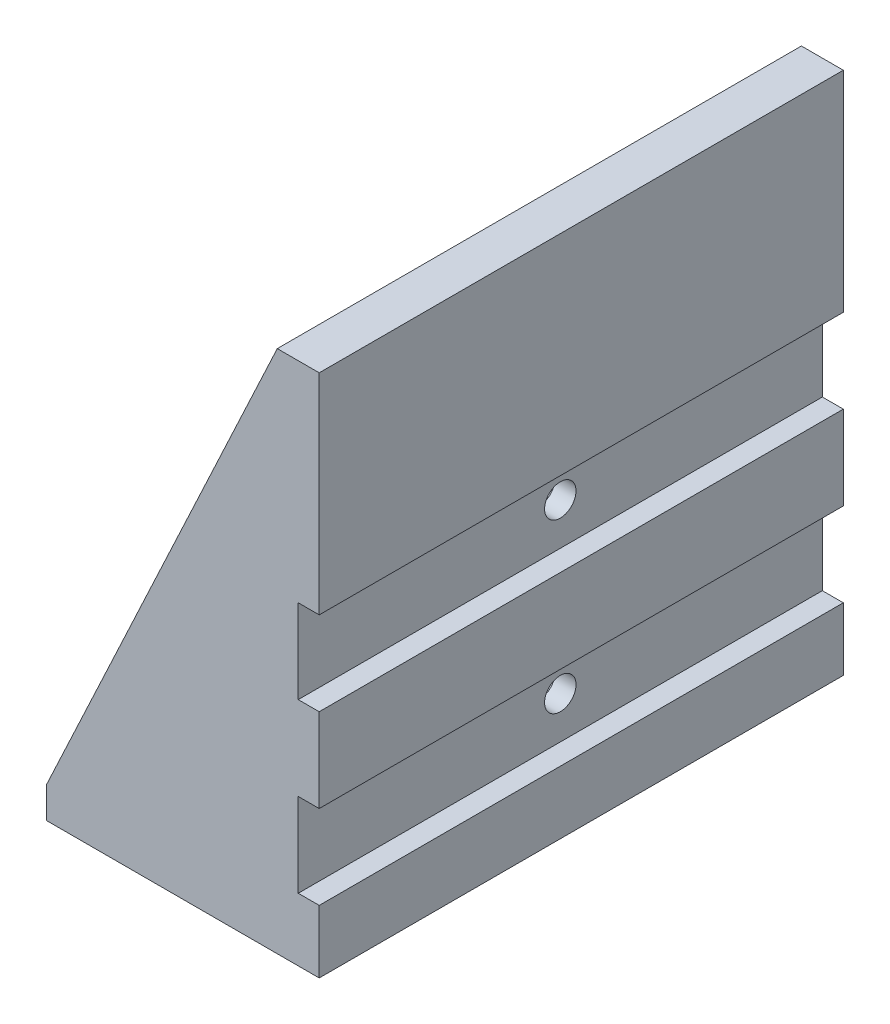
ISO-10303-21;
HEADER;
FILE_DESCRIPTION(('STEP AP214'),'2;1');
FILE_NAME('part.step','',(''),(''),'','','');
FILE_SCHEMA(('AUTOMOTIVE_DESIGN { 1 0 10303 214 1 1 1 1 }'));
ENDSEC;
DATA;
#1=APPLICATION_CONTEXT('core data for automotive mechanical design processes');
#2=APPLICATION_PROTOCOL_DEFINITION('international standard','automotive_design',2000,#1);
#3=PRODUCT_CONTEXT('',#1,'mechanical');
#4=PRODUCT('Part','Part','',(#3));
#5=PRODUCT_RELATED_PRODUCT_CATEGORY('part','',(#4));
#6=PRODUCT_DEFINITION_FORMATION('','',#4);
#7=PRODUCT_DEFINITION_CONTEXT('part definition',#1,'design');
#8=PRODUCT_DEFINITION('design','',#6,#7);
#9=PRODUCT_DEFINITION_SHAPE('','',#8);
#10=(LENGTH_UNIT() NAMED_UNIT(*) SI_UNIT(.MILLI.,.METRE.));
#11=(NAMED_UNIT(*) PLANE_ANGLE_UNIT() SI_UNIT($,.RADIAN.));
#12=(NAMED_UNIT(*) SI_UNIT($,.STERADIAN.) SOLID_ANGLE_UNIT());
#13=UNCERTAINTY_MEASURE_WITH_UNIT(LENGTH_MEASURE(1.E-05),#10,'distance_accuracy_value','');
#14=(GEOMETRIC_REPRESENTATION_CONTEXT(3) GLOBAL_UNCERTAINTY_ASSIGNED_CONTEXT((#13)) GLOBAL_UNIT_ASSIGNED_CONTEXT((#10,
#11,#12)) REPRESENTATION_CONTEXT('',''));
#15=CARTESIAN_POINT('',(0.,0.,0.));
#16=DIRECTION('',(0.,0.,1.));
#17=DIRECTION('',(1.,0.,0.));
#18=AXIS2_PLACEMENT_3D('',#15,#16,#17);
#19=CARTESIAN_POINT('',(-13.,3.,50.));
#20=DIRECTION('',(0.905690226558439,-0.423940106048631,0.));
#21=DIRECTION('',(0.423940106048631,0.905690226558439,0.));
#22=AXIS2_PLACEMENT_3D('',#19,#20,#21);
#23=PLANE('',#22);
#24=DIRECTION('',(0.,0.,-1.));
#25=VECTOR('',#24,1.);
#26=CARTESIAN_POINT('',(9.,50.,50.));
#27=LINE('',#26,#25);
#28=CARTESIAN_POINT('',(9.,50.,50.));
#29=VERTEX_POINT('',#28);
#30=CARTESIAN_POINT('',(9.,50.,47.5));
#31=VERTEX_POINT('',#30);
#32=EDGE_CURVE('E405',#29,#31,#27,.T.);
#33=ORIENTED_EDGE('',*,*,#32,.T.);
#34=DIRECTION('',(-0.423940106048631,-0.905690226558439,0.));
#35=VECTOR('',#34,1.);
#36=CARTESIAN_POINT('',(-13.,3.,47.5));
#37=LINE('',#36,#35);
#38=CARTESIAN_POINT('',(-10.6602168003031,7.99862774480703,47.5));
#39=VERTEX_POINT('',#38);
#40=EDGE_CURVE('E285',#31,#39,#37,.T.);
#41=ORIENTED_EDGE('',*,*,#40,.T.);
#42=CARTESIAN_POINT('',(-10.6602168003031,7.99862774480703,42.5));
#43=DIRECTION('',(0.905690226558439,-0.423940106048631,0.));
#44=DIRECTION('',(0.423940106048631,0.905690226558439,0.));
#45=AXIS2_PLACEMENT_3D('',#42,#43,#44);
#46=ELLIPSE('',#45,5.52065138099112,5.);
#47=CARTESIAN_POINT('',(-13.,3.,42.6171352587628));
#48=VERTEX_POINT('',#47);
#49=EDGE_CURVE('E533',#39,#48,#46,.T.);
#50=ORIENTED_EDGE('',*,*,#49,.T.);
#51=DIRECTION('',(0.,0.,-1.));
#52=VECTOR('',#51,1.);
#53=CARTESIAN_POINT('',(-13.,3.,50.));
#54=LINE('',#53,#52);
#55=CARTESIAN_POINT('',(-13.,3.,50.));
#56=VERTEX_POINT('',#55);
#57=EDGE_CURVE('E64',#56,#48,#54,.T.);
#58=ORIENTED_EDGE('',*,*,#57,.F.);
#59=DIRECTION('',(-0.423940106048631,-0.905690226558438,0.));
#60=VECTOR('',#59,1.);
#61=CARTESIAN_POINT('',(-13.,3.,50.));
#62=LINE('',#61,#60);
#63=EDGE_CURVE('E367',#29,#56,#62,.T.);
#64=ORIENTED_EDGE('',*,*,#63,.F.);
#65=EDGE_LOOP('',(#33,#41,#50,#58,#64));
#66=FACE_BOUND('',#65,.T.);
#67=ADVANCED_FACE('F39',(#66),#23,.F.);
#68=CARTESIAN_POINT('',(13.,0.,50.));
#69=DIRECTION('',(-1.,0.,0.));
#70=DIRECTION('',(0.,0.,1.));
#71=AXIS2_PLACEMENT_3D('',#68,#69,#70);
#72=PLANE('',#71);
#73=DIRECTION('',(0.,1.,0.));
#74=VECTOR('',#73,1.);
#75=CARTESIAN_POINT('',(13.,0.,50.));
#76=LINE('',#75,#74);
#77=CARTESIAN_POINT('',(13.,30.,50.));
#78=VERTEX_POINT('',#77);
#79=CARTESIAN_POINT('',(13.,50.,50.));
#80=VERTEX_POINT('',#79);
#81=EDGE_CURVE('E364',#78,#80,#76,.T.);
#82=ORIENTED_EDGE('',*,*,#81,.F.);
#83=DIRECTION('',(0.,0.,1.));
#84=VECTOR('',#83,1.);
#85=CARTESIAN_POINT('',(13.,30.,50.));
#86=LINE('',#85,#84);
#87=CARTESIAN_POINT('',(13.,30.,0.));
#88=VERTEX_POINT('',#87);
#89=EDGE_CURVE('E295',#88,#78,#86,.T.);
#90=ORIENTED_EDGE('',*,*,#89,.F.);
#91=DIRECTION('',(0.,1.,0.));
#92=VECTOR('',#91,1.);
#93=CARTESIAN_POINT('',(13.,0.,0.));
#94=LINE('',#93,#92);
#95=CARTESIAN_POINT('',(13.,50.,0.));
#96=VERTEX_POINT('',#95);
#97=EDGE_CURVE('E348',#88,#96,#94,.T.);
#98=ORIENTED_EDGE('',*,*,#97,.T.);
#99=DIRECTION('',(0.,0.,-1.));
#100=VECTOR('',#99,1.);
#101=CARTESIAN_POINT('',(13.,50.,50.));
#102=LINE('',#101,#100);
#103=EDGE_CURVE('E409',#80,#96,#102,.T.);
#104=ORIENTED_EDGE('',*,*,#103,.F.);
#105=EDGE_LOOP('',(#82,#90,#98,#104));
#106=FACE_BOUND('',#105,.T.);
#107=ADVANCED_FACE('F471',(#106),#72,.F.);
#108=CARTESIAN_POINT('',(13.,14.,0.));
#109=VERTEX_POINT('',#108);
#110=CARTESIAN_POINT('',(13.,22.,0.));
#111=VERTEX_POINT('',#110);
#112=EDGE_CURVE('E382',#109,#111,#94,.T.);
#113=ORIENTED_EDGE('',*,*,#112,.T.);
#114=DIRECTION('',(0.,0.,-1.));
#115=VECTOR('',#114,1.);
#116=CARTESIAN_POINT('',(13.,22.,50.));
#117=LINE('',#116,#115);
#118=CARTESIAN_POINT('',(13.,22.,50.));
#119=VERTEX_POINT('',#118);
#120=EDGE_CURVE('E289',#119,#111,#117,.T.);
#121=ORIENTED_EDGE('',*,*,#120,.F.);
#122=CARTESIAN_POINT('',(13.,14.,50.));
#123=VERTEX_POINT('',#122);
#124=EDGE_CURVE('E363',#123,#119,#76,.T.);
#125=ORIENTED_EDGE('',*,*,#124,.F.);
#126=DIRECTION('',(0.,0.,1.));
#127=VECTOR('',#126,1.);
#128=CARTESIAN_POINT('',(13.,14.,50.));
#129=LINE('',#128,#127);
#130=EDGE_CURVE('E329',#109,#123,#129,.T.);
#131=ORIENTED_EDGE('',*,*,#130,.F.);
#132=EDGE_LOOP('',(#113,#121,#125,#131));
#133=FACE_BOUND('',#132,.T.);
#134=ADVANCED_FACE('F478',(#133),#72,.F.);
#135=CARTESIAN_POINT('',(13.,0.,0.));
#136=VERTEX_POINT('',#135);
#137=CARTESIAN_POINT('',(13.,6.00000000000001,0.));
#138=VERTEX_POINT('',#137);
#139=EDGE_CURVE('E377',#136,#138,#94,.T.);
#140=ORIENTED_EDGE('',*,*,#139,.T.);
#141=DIRECTION('',(0.,0.,-1.));
#142=VECTOR('',#141,1.);
#143=CARTESIAN_POINT('',(13.,6.00000000000001,50.));
#144=LINE('',#143,#142);
#145=CARTESIAN_POINT('',(13.,6.00000000000001,50.));
#146=VERTEX_POINT('',#145);
#147=EDGE_CURVE('E314',#146,#138,#144,.T.);
#148=ORIENTED_EDGE('',*,*,#147,.F.);
#149=CARTESIAN_POINT('',(13.,0.,50.));
#150=VERTEX_POINT('',#149);
#151=EDGE_CURVE('E358',#150,#146,#76,.T.);
#152=ORIENTED_EDGE('',*,*,#151,.F.);
#153=DIRECTION('',(0.,0.,-1.));
#154=VECTOR('',#153,1.);
#155=CARTESIAN_POINT('',(13.,0.,50.));
#156=LINE('',#155,#154);
#157=EDGE_CURVE('E376',#150,#136,#156,.T.);
#158=ORIENTED_EDGE('',*,*,#157,.T.);
#159=EDGE_LOOP('',(#140,#148,#152,#158));
#160=FACE_BOUND('',#159,.T.);
#161=ADVANCED_FACE('F460',(#160),#72,.F.);
#162=CARTESIAN_POINT('',(9.,50.,50.));
#163=DIRECTION('',(0.,-1.,0.));
#164=DIRECTION('',(0.,0.,-1.));
#165=AXIS2_PLACEMENT_3D('',#162,#163,#164);
#166=PLANE('',#165);
#167=DIRECTION('',(-1.,0.,0.));
#168=VECTOR('',#167,1.);
#169=CARTESIAN_POINT('',(9.,50.,0.));
#170=LINE('',#169,#168);
#171=CARTESIAN_POINT('',(9.,50.,0.));
#172=VERTEX_POINT('',#171);
#173=EDGE_CURVE('E381',#96,#172,#170,.T.);
#174=ORIENTED_EDGE('',*,*,#173,.T.);
#175=CARTESIAN_POINT('',(9.,50.,2.5));
#176=VERTEX_POINT('',#175);
#177=EDGE_CURVE('E404',#176,#172,#27,.T.);
#178=ORIENTED_EDGE('',*,*,#177,.F.);
#179=DIRECTION('',(0.,0.,-1.));
#180=VECTOR('',#179,1.);
#181=CARTESIAN_POINT('',(9.,50.,2.5));
#182=LINE('',#181,#180);
#183=EDGE_CURVE('E268',#31,#176,#182,.T.);
#184=ORIENTED_EDGE('',*,*,#183,.F.);
#185=ORIENTED_EDGE('',*,*,#32,.F.);
#186=DIRECTION('',(-1.,0.,0.));
#187=VECTOR('',#186,1.);
#188=CARTESIAN_POINT('',(9.,50.,50.));
#189=LINE('',#188,#187);
#190=EDGE_CURVE('E362',#80,#29,#189,.T.);
#191=ORIENTED_EDGE('',*,*,#190,.F.);
#192=ORIENTED_EDGE('',*,*,#103,.T.);
#193=EDGE_LOOP('',(#174,#178,#184,#185,#191,#192));
#194=FACE_BOUND('',#193,.T.);
#195=ADVANCED_FACE('F483',(#194),#166,.F.);
#196=CARTESIAN_POINT('',(-13.,3.,7.38286474123698));
#197=VERTEX_POINT('',#196);
#198=CARTESIAN_POINT('',(-13.,3.,0.));
#199=VERTEX_POINT('',#198);
#200=EDGE_CURVE('E56',#197,#199,#54,.T.);
#201=ORIENTED_EDGE('',*,*,#200,.F.);
#202=CARTESIAN_POINT('',(-10.6602168003031,7.99862774480702,7.5));
#203=DIRECTION('',(0.905690226558439,-0.423940106048631,0.));
#204=DIRECTION('',(0.423940106048631,0.905690226558439,0.));
#205=AXIS2_PLACEMENT_3D('',#202,#203,#204);
#206=ELLIPSE('',#205,5.52065138099112,5.);
#207=CARTESIAN_POINT('',(-10.6602168003031,7.99862774480702,2.5));
#208=VERTEX_POINT('',#207);
#209=EDGE_CURVE('E11',#197,#208,#206,.T.);
#210=ORIENTED_EDGE('',*,*,#209,.T.);
#211=DIRECTION('',(0.423940106048631,0.905690226558439,0.));
#212=VECTOR('',#211,1.);
#213=CARTESIAN_POINT('',(-13.,3.,2.5));
#214=LINE('',#213,#212);
#215=EDGE_CURVE('E279',#208,#176,#214,.T.);
#216=ORIENTED_EDGE('',*,*,#215,.T.);
#217=ORIENTED_EDGE('',*,*,#177,.T.);
#218=DIRECTION('',(-0.423940106048631,-0.905690226558438,0.));
#219=VECTOR('',#218,1.);
#220=CARTESIAN_POINT('',(-13.,3.,0.));
#221=LINE('',#220,#219);
#222=EDGE_CURVE('E386',#172,#199,#221,.T.);
#223=ORIENTED_EDGE('',*,*,#222,.T.);
#224=EDGE_LOOP('',(#201,#210,#216,#217,#223));
#225=FACE_BOUND('',#224,.T.);
#226=ADVANCED_FACE('F474',(#225),#23,.F.);
#227=CARTESIAN_POINT('',(-13.,0.,50.));
#228=DIRECTION('',(1.,0.,0.));
#229=DIRECTION('',(0.,0.,-1.));
#230=AXIS2_PLACEMENT_3D('',#227,#228,#229);
#231=PLANE('',#230);
#232=ORIENTED_EDGE('',*,*,#57,.T.);
#233=CARTESIAN_POINT('',(-13.,7.99862774480703,42.5));
#234=DIRECTION('',(1.,0.,0.));
#235=DIRECTION('',(0.,0.,-1.));
#236=AXIS2_PLACEMENT_3D('',#233,#234,#235);
#237=CIRCLE('',#236,5.);
#238=CARTESIAN_POINT('',(-13.,2.99862774480703,42.5));
#239=VERTEX_POINT('',#238);
#240=EDGE_CURVE('E535',#48,#239,#237,.T.);
#241=ORIENTED_EDGE('',*,*,#240,.T.);
#242=DIRECTION('',(0.,0.,1.));
#243=VECTOR('',#242,1.);
#244=CARTESIAN_POINT('',(-13.,2.99862774480702,2.5));
#245=LINE('',#244,#243);
#246=CARTESIAN_POINT('',(-13.,2.99862774480702,7.5));
#247=VERTEX_POINT('',#246);
#248=EDGE_CURVE('E267',#247,#239,#245,.T.);
#249=ORIENTED_EDGE('',*,*,#248,.F.);
#250=CARTESIAN_POINT('',(-13.,7.99862774480702,7.5));
#251=DIRECTION('',(1.,0.,0.));
#252=DIRECTION('',(0.,0.,-1.));
#253=AXIS2_PLACEMENT_3D('',#250,#251,#252);
#254=CIRCLE('',#253,5.);
#255=EDGE_CURVE('E49',#247,#197,#254,.T.);
#256=ORIENTED_EDGE('',*,*,#255,.T.);
#257=ORIENTED_EDGE('',*,*,#200,.T.);
#258=DIRECTION('',(0.,-1.,0.));
#259=VECTOR('',#258,1.);
#260=CARTESIAN_POINT('',(-13.,0.,0.));
#261=LINE('',#260,#259);
#262=CARTESIAN_POINT('',(-13.,0.,0.));
#263=VERTEX_POINT('',#262);
#264=EDGE_CURVE('E389',#199,#263,#261,.T.);
#265=ORIENTED_EDGE('',*,*,#264,.T.);
#266=DIRECTION('',(0.,0.,-1.));
#267=VECTOR('',#266,1.);
#268=CARTESIAN_POINT('',(-13.,0.,50.));
#269=LINE('',#268,#267);
#270=CARTESIAN_POINT('',(-13.,0.,50.));
#271=VERTEX_POINT('',#270);
#272=EDGE_CURVE('E398',#271,#263,#269,.T.);
#273=ORIENTED_EDGE('',*,*,#272,.F.);
#274=DIRECTION('',(0.,-1.,0.));
#275=VECTOR('',#274,1.);
#276=CARTESIAN_POINT('',(-13.,0.,50.));
#277=LINE('',#276,#275);
#278=EDGE_CURVE('E370',#56,#271,#277,.T.);
#279=ORIENTED_EDGE('',*,*,#278,.F.);
#280=EDGE_LOOP('',(#232,#241,#249,#256,#257,#265,#273,#279));
#281=FACE_BOUND('',#280,.T.);
#282=ADVANCED_FACE('F482',(#281),#231,.F.);
#283=CARTESIAN_POINT('',(-13.,0.,50.));
#284=DIRECTION('',(0.,1.,0.));
#285=DIRECTION('',(-1.,0.,0.));
#286=AXIS2_PLACEMENT_3D('',#283,#284,#285);
#287=PLANE('',#286);
#288=DIRECTION('',(1.,0.,0.));
#289=VECTOR('',#288,1.);
#290=CARTESIAN_POINT('',(-10.,0.,24.));
#291=LINE('',#290,#289);
#292=CARTESIAN_POINT('',(-10.,0.,24.));
#293=VERTEX_POINT('',#292);
#294=CARTESIAN_POINT('',(6.,0.,24.));
#295=VERTEX_POINT('',#294);
#296=EDGE_CURVE('E518',#293,#295,#291,.T.);
#297=ORIENTED_EDGE('',*,*,#296,.F.);
#298=CARTESIAN_POINT('',(-10.,0.,25.));
#299=DIRECTION('',(0.,1.,0.));
#300=DIRECTION('',(-1.,0.,0.));
#301=AXIS2_PLACEMENT_3D('',#298,#299,#300);
#302=CIRCLE('',#301,1.);
#303=CARTESIAN_POINT('',(-10.,0.,26.));
#304=VERTEX_POINT('',#303);
#305=EDGE_CURVE('E223',#304,#293,#302,.F.);
#306=ORIENTED_EDGE('',*,*,#305,.F.);
#307=DIRECTION('',(-1.,0.,0.));
#308=VECTOR('',#307,1.);
#309=CARTESIAN_POINT('',(-10.,0.,26.));
#310=LINE('',#309,#308);
#311=CARTESIAN_POINT('',(6.,0.,26.));
#312=VERTEX_POINT('',#311);
#313=EDGE_CURVE('E248',#312,#304,#310,.T.);
#314=ORIENTED_EDGE('',*,*,#313,.F.);
#315=CARTESIAN_POINT('',(6.,0.,25.));
#316=DIRECTION('',(0.,1.,0.));
#317=DIRECTION('',(-1.,0.,0.));
#318=AXIS2_PLACEMENT_3D('',#315,#316,#317);
#319=CIRCLE('',#318,1.);
#320=EDGE_CURVE('E225',#295,#312,#319,.F.);
#321=ORIENTED_EDGE('',*,*,#320,.F.);
#322=EDGE_LOOP('',(#297,#306,#314,#321));
#323=FACE_BOUND('',#322,.T.);
#324=DIRECTION('',(1.,0.,0.));
#325=VECTOR('',#324,1.);
#326=CARTESIAN_POINT('',(-13.,0.,0.));
#327=LINE('',#326,#325);
#328=EDGE_CURVE('E392',#263,#136,#327,.T.);
#329=ORIENTED_EDGE('',*,*,#328,.T.);
#330=ORIENTED_EDGE('',*,*,#157,.F.);
#331=DIRECTION('',(1.,0.,0.));
#332=VECTOR('',#331,1.);
#333=CARTESIAN_POINT('',(-13.,0.,50.));
#334=LINE('',#333,#332);
#335=EDGE_CURVE('E373',#271,#150,#334,.T.);
#336=ORIENTED_EDGE('',*,*,#335,.F.);
#337=ORIENTED_EDGE('',*,*,#272,.T.);
#338=EDGE_LOOP('',(#329,#330,#336,#337));
#339=FACE_BOUND('',#338,.T.);
#340=ADVANCED_FACE('F488',(#323,#339),#287,.F.);
#341=CARTESIAN_POINT('',(0.,0.,50.));
#342=DIRECTION('',(0.,0.,-1.));
#343=DIRECTION('',(-1.,0.,0.));
#344=AXIS2_PLACEMENT_3D('',#341,#342,#343);
#345=PLANE('',#344);
#346=DIRECTION('',(0.,-1.,0.));
#347=VECTOR('',#346,1.);
#348=CARTESIAN_POINT('',(11.,22.,50.));
#349=LINE('',#348,#347);
#350=CARTESIAN_POINT('',(11.,30.,50.));
#351=VERTEX_POINT('',#350);
#352=CARTESIAN_POINT('',(11.,22.,50.));
#353=VERTEX_POINT('',#352);
#354=EDGE_CURVE('E290',#351,#353,#349,.T.);
#355=ORIENTED_EDGE('',*,*,#354,.F.);
#356=DIRECTION('',(1.,0.,0.));
#357=VECTOR('',#356,1.);
#358=CARTESIAN_POINT('',(11.,30.,50.));
#359=LINE('',#358,#357);
#360=EDGE_CURVE('E310',#351,#78,#359,.T.);
#361=ORIENTED_EDGE('',*,*,#360,.T.);
#362=ORIENTED_EDGE('',*,*,#81,.T.);
#363=ORIENTED_EDGE('',*,*,#190,.T.);
#364=ORIENTED_EDGE('',*,*,#63,.T.);
#365=ORIENTED_EDGE('',*,*,#278,.T.);
#366=ORIENTED_EDGE('',*,*,#335,.T.);
#367=ORIENTED_EDGE('',*,*,#151,.T.);
#368=DIRECTION('',(1.,0.,0.));
#369=VECTOR('',#368,1.);
#370=CARTESIAN_POINT('',(11.,6.00000000000001,50.));
#371=LINE('',#370,#369);
#372=CARTESIAN_POINT('',(11.,6.00000000000001,50.));
#373=VERTEX_POINT('',#372);
#374=EDGE_CURVE('E339',#373,#146,#371,.T.);
#375=ORIENTED_EDGE('',*,*,#374,.F.);
#376=DIRECTION('',(0.,-1.,0.));
#377=VECTOR('',#376,1.);
#378=CARTESIAN_POINT('',(11.,14.,50.));
#379=LINE('',#378,#377);
#380=CARTESIAN_POINT('',(11.,14.,50.));
#381=VERTEX_POINT('',#380);
#382=EDGE_CURVE('E324',#381,#373,#379,.T.);
#383=ORIENTED_EDGE('',*,*,#382,.F.);
#384=DIRECTION('',(1.,0.,0.));
#385=VECTOR('',#384,1.);
#386=CARTESIAN_POINT('',(11.,14.,50.));
#387=LINE('',#386,#385);
#388=EDGE_CURVE('E344',#381,#123,#387,.T.);
#389=ORIENTED_EDGE('',*,*,#388,.T.);
#390=ORIENTED_EDGE('',*,*,#124,.T.);
#391=DIRECTION('',(1.,0.,0.));
#392=VECTOR('',#391,1.);
#393=CARTESIAN_POINT('',(11.,22.,50.));
#394=LINE('',#393,#392);
#395=EDGE_CURVE('E305',#353,#119,#394,.T.);
#396=ORIENTED_EDGE('',*,*,#395,.F.);
#397=EDGE_LOOP('',(#355,#361,#362,#363,#364,#365,#366,#367,#375,#383,#389,#390,#396));
#398=FACE_BOUND('',#397,.T.);
#399=ADVANCED_FACE('F557',(#398),#345,.F.);
#400=CARTESIAN_POINT('',(0.,0.,0.));
#401=DIRECTION('',(0.,0.,-1.));
#402=DIRECTION('',(-1.,0.,0.));
#403=AXIS2_PLACEMENT_3D('',#400,#401,#402);
#404=PLANE('',#403);
#405=DIRECTION('',(1.,0.,0.));
#406=VECTOR('',#405,1.);
#407=CARTESIAN_POINT('',(11.,30.,0.));
#408=LINE('',#407,#406);
#409=CARTESIAN_POINT('',(11.,30.,0.));
#410=VERTEX_POINT('',#409);
#411=EDGE_CURVE('E315',#410,#88,#408,.T.);
#412=ORIENTED_EDGE('',*,*,#411,.F.);
#413=DIRECTION('',(0.,1.,0.));
#414=VECTOR('',#413,1.);
#415=CARTESIAN_POINT('',(11.,22.,0.));
#416=LINE('',#415,#414);
#417=CARTESIAN_POINT('',(11.,22.,0.));
#418=VERTEX_POINT('',#417);
#419=EDGE_CURVE('E298',#418,#410,#416,.T.);
#420=ORIENTED_EDGE('',*,*,#419,.F.);
#421=DIRECTION('',(1.,0.,0.));
#422=VECTOR('',#421,1.);
#423=CARTESIAN_POINT('',(11.,22.,0.));
#424=LINE('',#423,#422);
#425=EDGE_CURVE('E318',#418,#111,#424,.T.);
#426=ORIENTED_EDGE('',*,*,#425,.T.);
#427=ORIENTED_EDGE('',*,*,#112,.F.);
#428=DIRECTION('',(1.,0.,0.));
#429=VECTOR('',#428,1.);
#430=CARTESIAN_POINT('',(11.,14.,0.));
#431=LINE('',#430,#429);
#432=CARTESIAN_POINT('',(11.,14.,0.));
#433=VERTEX_POINT('',#432);
#434=EDGE_CURVE('E349',#433,#109,#431,.T.);
#435=ORIENTED_EDGE('',*,*,#434,.F.);
#436=DIRECTION('',(0.,1.,0.));
#437=VECTOR('',#436,1.);
#438=CARTESIAN_POINT('',(11.,14.,0.));
#439=LINE('',#438,#437);
#440=CARTESIAN_POINT('',(11.,6.00000000000001,0.));
#441=VERTEX_POINT('',#440);
#442=EDGE_CURVE('E332',#441,#433,#439,.T.);
#443=ORIENTED_EDGE('',*,*,#442,.F.);
#444=DIRECTION('',(1.,0.,0.));
#445=VECTOR('',#444,1.);
#446=CARTESIAN_POINT('',(11.,6.00000000000001,0.));
#447=LINE('',#446,#445);
#448=EDGE_CURVE('E352',#441,#138,#447,.T.);
#449=ORIENTED_EDGE('',*,*,#448,.T.);
#450=ORIENTED_EDGE('',*,*,#139,.F.);
#451=ORIENTED_EDGE('',*,*,#328,.F.);
#452=ORIENTED_EDGE('',*,*,#264,.F.);
#453=ORIENTED_EDGE('',*,*,#222,.F.);
#454=ORIENTED_EDGE('',*,*,#173,.F.);
#455=ORIENTED_EDGE('',*,*,#97,.F.);
#456=EDGE_LOOP('',(#412,#420,#426,#427,#435,#443,#449,#450,#451,#452,#453,#454,#455));
#457=FACE_BOUND('',#456,.T.);
#458=ADVANCED_FACE('F504',(#457),#404,.T.);
#459=CARTESIAN_POINT('',(11.,14.,50.));
#460=DIRECTION('',(0.,1.,0.));
#461=DIRECTION('',(0.,0.,1.));
#462=AXIS2_PLACEMENT_3D('',#459,#460,#461);
#463=PLANE('',#462);
#464=ORIENTED_EDGE('',*,*,#130,.T.);
#465=ORIENTED_EDGE('',*,*,#388,.F.);
#466=DIRECTION('',(0.,0.,1.));
#467=VECTOR('',#466,1.);
#468=CARTESIAN_POINT('',(11.,14.,50.));
#469=LINE('',#468,#467);
#470=EDGE_CURVE('E335',#433,#381,#469,.T.);
#471=ORIENTED_EDGE('',*,*,#470,.F.);
#472=ORIENTED_EDGE('',*,*,#434,.T.);
#473=EDGE_LOOP('',(#464,#465,#471,#472));
#474=FACE_BOUND('',#473,.T.);
#475=ADVANCED_FACE('F580',(#474),#463,.F.);
#476=CARTESIAN_POINT('',(11.,6.00000000000001,50.));
#477=DIRECTION('',(0.,-1.,0.));
#478=DIRECTION('',(0.,0.,-1.));
#479=AXIS2_PLACEMENT_3D('',#476,#477,#478);
#480=PLANE('',#479);
#481=ORIENTED_EDGE('',*,*,#147,.T.);
#482=ORIENTED_EDGE('',*,*,#448,.F.);
#483=DIRECTION('',(0.,0.,-1.));
#484=VECTOR('',#483,1.);
#485=CARTESIAN_POINT('',(11.,6.00000000000001,50.));
#486=LINE('',#485,#484);
#487=EDGE_CURVE('E328',#373,#441,#486,.T.);
#488=ORIENTED_EDGE('',*,*,#487,.F.);
#489=ORIENTED_EDGE('',*,*,#374,.T.);
#490=EDGE_LOOP('',(#481,#482,#488,#489));
#491=FACE_BOUND('',#490,.T.);
#492=ADVANCED_FACE('F588',(#491),#480,.F.);
#493=CARTESIAN_POINT('',(11.,0.,0.));
#494=DIRECTION('',(1.,0.,0.));
#495=DIRECTION('',(0.,0.,-1.));
#496=AXIS2_PLACEMENT_3D('',#493,#494,#495);
#497=PLANE('',#496);
#498=CARTESIAN_POINT('',(11.,10.,25.));
#499=DIRECTION('',(1.,0.,0.));
#500=DIRECTION('',(0.,0.,-1.));
#501=AXIS2_PLACEMENT_3D('',#498,#499,#500);
#502=CIRCLE('',#501,1.5);
#503=CARTESIAN_POINT('',(11.,10.,23.5));
#504=VERTEX_POINT('',#503);
#505=EDGE_CURVE('E251',#504,#504,#502,.T.);
#506=ORIENTED_EDGE('',*,*,#505,.F.);
#507=EDGE_LOOP('',(#506));
#508=FACE_BOUND('',#507,.T.);
#509=ORIENTED_EDGE('',*,*,#382,.T.);
#510=ORIENTED_EDGE('',*,*,#487,.T.);
#511=ORIENTED_EDGE('',*,*,#442,.T.);
#512=ORIENTED_EDGE('',*,*,#470,.T.);
#513=EDGE_LOOP('',(#509,#510,#511,#512));
#514=FACE_BOUND('',#513,.T.);
#515=ADVANCED_FACE('F583',(#508,#514),#497,.T.);
#516=CARTESIAN_POINT('',(11.,30.,50.));
#517=DIRECTION('',(0.,1.,0.));
#518=DIRECTION('',(0.,0.,1.));
#519=AXIS2_PLACEMENT_3D('',#516,#517,#518);
#520=PLANE('',#519);
#521=ORIENTED_EDGE('',*,*,#89,.T.);
#522=ORIENTED_EDGE('',*,*,#360,.F.);
#523=DIRECTION('',(0.,0.,1.));
#524=VECTOR('',#523,1.);
#525=CARTESIAN_POINT('',(11.,30.,50.));
#526=LINE('',#525,#524);
#527=EDGE_CURVE('E301',#410,#351,#526,.T.);
#528=ORIENTED_EDGE('',*,*,#527,.F.);
#529=ORIENTED_EDGE('',*,*,#411,.T.);
#530=EDGE_LOOP('',(#521,#522,#528,#529));
#531=FACE_BOUND('',#530,.T.);
#532=ADVANCED_FACE('F564',(#531),#520,.F.);
#533=CARTESIAN_POINT('',(11.,22.,50.));
#534=DIRECTION('',(0.,-1.,0.));
#535=DIRECTION('',(0.,0.,-1.));
#536=AXIS2_PLACEMENT_3D('',#533,#534,#535);
#537=PLANE('',#536);
#538=ORIENTED_EDGE('',*,*,#120,.T.);
#539=ORIENTED_EDGE('',*,*,#425,.F.);
#540=DIRECTION('',(0.,0.,-1.));
#541=VECTOR('',#540,1.);
#542=CARTESIAN_POINT('',(11.,22.,50.));
#543=LINE('',#542,#541);
#544=EDGE_CURVE('E294',#353,#418,#543,.T.);
#545=ORIENTED_EDGE('',*,*,#544,.F.);
#546=ORIENTED_EDGE('',*,*,#395,.T.);
#547=EDGE_LOOP('',(#538,#539,#545,#546));
#548=FACE_BOUND('',#547,.T.);
#549=ADVANCED_FACE('F571',(#548),#537,.F.);
#550=CARTESIAN_POINT('',(11.,0.,0.));
#551=DIRECTION('',(-1.,0.,0.));
#552=DIRECTION('',(0.,0.,1.));
#553=AXIS2_PLACEMENT_3D('',#550,#551,#552);
#554=PLANE('',#553);
#555=CARTESIAN_POINT('',(11.,26.,25.));
#556=DIRECTION('',(1.,0.,0.));
#557=DIRECTION('',(0.,0.,-1.));
#558=AXIS2_PLACEMENT_3D('',#555,#556,#557);
#559=CIRCLE('',#558,1.5);
#560=CARTESIAN_POINT('',(11.,26.,23.5));
#561=VERTEX_POINT('',#560);
#562=EDGE_CURVE('E259',#561,#561,#559,.T.);
#563=ORIENTED_EDGE('',*,*,#562,.F.);
#564=EDGE_LOOP('',(#563));
#565=FACE_BOUND('',#564,.T.);
#566=ORIENTED_EDGE('',*,*,#354,.T.);
#567=ORIENTED_EDGE('',*,*,#544,.T.);
#568=ORIENTED_EDGE('',*,*,#419,.T.);
#569=ORIENTED_EDGE('',*,*,#527,.T.);
#570=EDGE_LOOP('',(#566,#567,#568,#569));
#571=FACE_BOUND('',#570,.T.);
#572=ADVANCED_FACE('F566',(#565,#571),#554,.F.);
#573=CARTESIAN_POINT('',(9.,2.99862774480703,47.5));
#574=DIRECTION('',(0.,0.,1.));
#575=DIRECTION('',(1.,0.,0.));
#576=AXIS2_PLACEMENT_3D('',#573,#574,#575);
#577=PLANE('',#576);
#578=DIRECTION('',(0.,1.,0.));
#579=VECTOR('',#578,1.);
#580=CARTESIAN_POINT('',(9.,2.99862774480703,47.5));
#581=LINE('',#580,#579);
#582=CARTESIAN_POINT('',(9.,7.99862774480703,47.5));
#583=VERTEX_POINT('',#582);
#584=EDGE_CURVE('E276',#583,#31,#581,.T.);
#585=ORIENTED_EDGE('',*,*,#584,.F.);
#586=DIRECTION('',(-1.,0.,0.));
#587=VECTOR('',#586,1.);
#588=CARTESIAN_POINT('',(-13.,7.99862774480703,47.5));
#589=LINE('',#588,#587);
#590=EDGE_CURVE('E429',#583,#39,#589,.T.);
#591=ORIENTED_EDGE('',*,*,#590,.T.);
#592=ORIENTED_EDGE('',*,*,#40,.F.);
#593=EDGE_LOOP('',(#585,#591,#592));
#594=FACE_BOUND('',#593,.T.);
#595=ADVANCED_FACE('F552',(#594),#577,.F.);
#596=CARTESIAN_POINT('',(9.,50.,2.5));
#597=DIRECTION('',(0.,0.,-1.));
#598=DIRECTION('',(0.,1.,0.));
#599=AXIS2_PLACEMENT_3D('',#596,#597,#598);
#600=PLANE('',#599);
#601=ORIENTED_EDGE('',*,*,#215,.F.);
#602=DIRECTION('',(-1.,0.,0.));
#603=VECTOR('',#602,1.);
#604=CARTESIAN_POINT('',(9.,7.99862774480702,2.5));
#605=LINE('',#604,#603);
#606=CARTESIAN_POINT('',(9.,7.99862774480702,2.5));
#607=VERTEX_POINT('',#606);
#608=EDGE_CURVE('E432',#208,#607,#605,.F.);
#609=ORIENTED_EDGE('',*,*,#608,.T.);
#610=DIRECTION('',(0.,-1.,0.));
#611=VECTOR('',#610,1.);
#612=CARTESIAN_POINT('',(9.,50.,2.5));
#613=LINE('',#612,#611);
#614=EDGE_CURVE('E272',#176,#607,#613,.T.);
#615=ORIENTED_EDGE('',*,*,#614,.F.);
#616=EDGE_LOOP('',(#601,#609,#615));
#617=FACE_BOUND('',#616,.T.);
#618=ADVANCED_FACE('F599',(#617),#600,.F.);
#619=CARTESIAN_POINT('',(9.,2.99862774480702,2.5));
#620=DIRECTION('',(0.,-1.,0.));
#621=DIRECTION('',(0.,0.,-1.));
#622=AXIS2_PLACEMENT_3D('',#619,#620,#621);
#623=PLANE('',#622);
#624=DIRECTION('',(-1.,0.,0.));
#625=VECTOR('',#624,1.);
#626=CARTESIAN_POINT('',(9.,2.99862774480703,42.5));
#627=LINE('',#626,#625);
#628=CARTESIAN_POINT('',(4.,2.99862774480703,42.5));
#629=VERTEX_POINT('',#628);
#630=EDGE_CURVE('E423',#239,#629,#627,.F.);
#631=ORIENTED_EDGE('',*,*,#630,.T.);
#632=DIRECTION('',(0.,0.,1.));
#633=VECTOR('',#632,1.);
#634=CARTESIAN_POINT('',(4.,2.99862774480702,2.5));
#635=LINE('',#634,#633);
#636=CARTESIAN_POINT('',(4.,2.99862774480702,26.));
#637=VERTEX_POINT('',#636);
#638=EDGE_CURVE('E426',#629,#637,#635,.F.);
#639=ORIENTED_EDGE('',*,*,#638,.T.);
#640=DIRECTION('',(1.,0.,0.));
#641=VECTOR('',#640,1.);
#642=CARTESIAN_POINT('',(-10.,2.99862774480702,26.));
#643=LINE('',#642,#641);
#644=CARTESIAN_POINT('',(-10.,2.99862774480702,26.));
#645=VERTEX_POINT('',#644);
#646=EDGE_CURVE('E215',#645,#637,#643,.T.);
#647=ORIENTED_EDGE('',*,*,#646,.F.);
#648=CARTESIAN_POINT('',(-10.,2.99862774480702,25.));
#649=DIRECTION('',(0.,1.,0.));
#650=DIRECTION('',(0.,0.,1.));
#651=AXIS2_PLACEMENT_3D('',#648,#649,#650);
#652=CIRCLE('',#651,1.);
#653=CARTESIAN_POINT('',(-10.,2.99862774480702,24.));
#654=VERTEX_POINT('',#653);
#655=EDGE_CURVE('E220',#654,#645,#652,.T.);
#656=ORIENTED_EDGE('',*,*,#655,.F.);
#657=DIRECTION('',(-1.,0.,0.));
#658=VECTOR('',#657,1.);
#659=CARTESIAN_POINT('',(-10.,2.99862774480702,24.));
#660=LINE('',#659,#658);
#661=CARTESIAN_POINT('',(4.,2.99862774480702,24.));
#662=VERTEX_POINT('',#661);
#663=EDGE_CURVE('E203',#662,#654,#660,.T.);
#664=ORIENTED_EDGE('',*,*,#663,.F.);
#665=DIRECTION('',(0.,0.,1.));
#666=VECTOR('',#665,1.);
#667=CARTESIAN_POINT('',(4.,2.99862774480702,2.5));
#668=LINE('',#667,#666);
#669=CARTESIAN_POINT('',(4.,2.99862774480702,7.5));
#670=VERTEX_POINT('',#669);
#671=EDGE_CURVE('E420',#662,#670,#668,.F.);
#672=ORIENTED_EDGE('',*,*,#671,.T.);
#673=DIRECTION('',(-1.,0.,0.));
#674=VECTOR('',#673,1.);
#675=CARTESIAN_POINT('',(-13.,2.99862774480702,7.5));
#676=LINE('',#675,#674);
#677=EDGE_CURVE('E417',#670,#247,#676,.T.);
#678=ORIENTED_EDGE('',*,*,#677,.T.);
#679=ORIENTED_EDGE('',*,*,#248,.T.);
#680=EDGE_LOOP('',(#631,#639,#647,#656,#664,#672,#678,#679));
#681=FACE_BOUND('',#680,.T.);
#682=ADVANCED_FACE('F229',(#681),#623,.F.);
#683=CARTESIAN_POINT('',(9.,0.,0.));
#684=DIRECTION('',(-1.,0.,0.));
#685=DIRECTION('',(0.,0.,1.));
#686=AXIS2_PLACEMENT_3D('',#683,#684,#685);
#687=PLANE('',#686);
#688=CARTESIAN_POINT('',(9.,10.,25.));
#689=DIRECTION('',(-1.,0.,0.));
#690=DIRECTION('',(0.,0.,1.));
#691=AXIS2_PLACEMENT_3D('',#688,#689,#690);
#692=CIRCLE('',#691,1.5);
#693=CARTESIAN_POINT('',(9.,10.,26.5));
#694=VERTEX_POINT('',#693);
#695=EDGE_CURVE('E255',#694,#694,#692,.F.);
#696=ORIENTED_EDGE('',*,*,#695,.T.);
#697=EDGE_LOOP('',(#696));
#698=FACE_BOUND('',#697,.T.);
#699=CARTESIAN_POINT('',(9.,26.,25.));
#700=DIRECTION('',(-1.,0.,0.));
#701=DIRECTION('',(0.,0.,1.));
#702=AXIS2_PLACEMENT_3D('',#699,#700,#701);
#703=CIRCLE('',#702,1.5);
#704=CARTESIAN_POINT('',(9.,26.,26.5));
#705=VERTEX_POINT('',#704);
#706=EDGE_CURVE('E263',#705,#705,#703,.F.);
#707=ORIENTED_EDGE('',*,*,#706,.T.);
#708=EDGE_LOOP('',(#707));
#709=FACE_BOUND('',#708,.T.);
#710=ORIENTED_EDGE('',*,*,#614,.T.);
#711=DIRECTION('',(0.,0.,1.));
#712=VECTOR('',#711,1.);
#713=CARTESIAN_POINT('',(9.,7.99862774480702,0.));
#714=LINE('',#713,#712);
#715=EDGE_CURVE('E413',#607,#583,#714,.T.);
#716=ORIENTED_EDGE('',*,*,#715,.T.);
#717=ORIENTED_EDGE('',*,*,#584,.T.);
#718=ORIENTED_EDGE('',*,*,#183,.T.);
#719=EDGE_LOOP('',(#710,#716,#717,#718));
#720=FACE_BOUND('',#719,.T.);
#721=ADVANCED_FACE('F550',(#698,#709,#720),#687,.T.);
#722=CARTESIAN_POINT('',(4.75735931288072,26.,25.));
#723=DIRECTION('',(1.,0.,0.));
#724=DIRECTION('',(0.,0.,-1.));
#725=AXIS2_PLACEMENT_3D('',#722,#723,#724);
#726=CYLINDRICAL_SURFACE('',#725,1.5);
#727=ORIENTED_EDGE('',*,*,#562,.T.);
#728=EDGE_LOOP('',(#727));
#729=FACE_BOUND('',#728,.T.);
#730=ORIENTED_EDGE('',*,*,#706,.F.);
#731=EDGE_LOOP('',(#730));
#732=FACE_BOUND('',#731,.T.);
#733=ADVANCED_FACE('F694',(#729,#732),#726,.F.);
#734=CARTESIAN_POINT('',(4.75735931288072,10.,25.));
#735=DIRECTION('',(1.,0.,0.));
#736=DIRECTION('',(0.,0.,-1.));
#737=AXIS2_PLACEMENT_3D('',#734,#735,#736);
#738=CYLINDRICAL_SURFACE('',#737,1.5);
#739=ORIENTED_EDGE('',*,*,#505,.T.);
#740=EDGE_LOOP('',(#739));
#741=FACE_BOUND('',#740,.T.);
#742=ORIENTED_EDGE('',*,*,#695,.F.);
#743=EDGE_LOOP('',(#742));
#744=FACE_BOUND('',#743,.T.);
#745=ADVANCED_FACE('F742',(#741,#744),#738,.F.);
#746=CARTESIAN_POINT('',(-10.,-18.1107702762748,25.));
#747=DIRECTION('',(0.,1.,0.));
#748=DIRECTION('',(0.,0.,1.));
#749=AXIS2_PLACEMENT_3D('',#746,#747,#748);
#750=CYLINDRICAL_SURFACE('',#749,1.);
#751=ORIENTED_EDGE('',*,*,#305,.T.);
#752=DIRECTION('',(0.,1.,0.));
#753=VECTOR('',#752,1.);
#754=CARTESIAN_POINT('',(-10.,-18.1107702762748,24.));
#755=LINE('',#754,#753);
#756=EDGE_CURVE('E206',#293,#654,#755,.T.);
#757=ORIENTED_EDGE('',*,*,#756,.T.);
#758=ORIENTED_EDGE('',*,*,#655,.T.);
#759=DIRECTION('',(0.,1.,0.));
#760=VECTOR('',#759,1.);
#761=CARTESIAN_POINT('',(-10.,-18.1107702762748,26.));
#762=LINE('',#761,#760);
#763=EDGE_CURVE('E214',#304,#645,#762,.T.);
#764=ORIENTED_EDGE('',*,*,#763,.F.);
#765=EDGE_LOOP('',(#751,#757,#758,#764));
#766=FACE_BOUND('',#765,.T.);
#767=ADVANCED_FACE('F218',(#766),#750,.F.);
#768=CARTESIAN_POINT('',(-10.,-18.1107702762748,24.));
#769=DIRECTION('',(0.,0.,-1.));
#770=DIRECTION('',(-1.,0.,0.));
#771=AXIS2_PLACEMENT_3D('',#768,#769,#770);
#772=PLANE('',#771);
#773=ORIENTED_EDGE('',*,*,#296,.T.);
#774=DIRECTION('',(0.,1.,0.));
#775=VECTOR('',#774,1.);
#776=CARTESIAN_POINT('',(6.,-18.1107702762748,24.));
#777=LINE('',#776,#775);
#778=CARTESIAN_POINT('',(6.,3.41605204985119,24.));
#779=VERTEX_POINT('',#778);
#780=EDGE_CURVE('E226',#295,#779,#777,.T.);
#781=ORIENTED_EDGE('',*,*,#780,.T.);
#782=CARTESIAN_POINT('',(4.,7.99862774480702,24.));
#783=DIRECTION('',(0.,0.,-1.));
#784=DIRECTION('',(-1.,0.,0.));
#785=AXIS2_PLACEMENT_3D('',#782,#783,#784);
#786=CIRCLE('',#785,5.);
#787=EDGE_CURVE('E209',#779,#662,#786,.T.);
#788=ORIENTED_EDGE('',*,*,#787,.T.);
#789=ORIENTED_EDGE('',*,*,#663,.T.);
#790=ORIENTED_EDGE('',*,*,#756,.F.);
#791=EDGE_LOOP('',(#773,#781,#788,#789,#790));
#792=FACE_BOUND('',#791,.T.);
#793=ADVANCED_FACE('F205',(#792),#772,.F.);
#794=CARTESIAN_POINT('',(6.,-18.1107702762748,25.));
#795=DIRECTION('',(0.,1.,0.));
#796=DIRECTION('',(0.,0.,1.));
#797=AXIS2_PLACEMENT_3D('',#794,#795,#796);
#798=CYLINDRICAL_SURFACE('',#797,1.);
#799=ORIENTED_EDGE('',*,*,#320,.T.);
#800=DIRECTION('',(0.,1.,0.));
#801=VECTOR('',#800,1.);
#802=CARTESIAN_POINT('',(6.,-18.1107702762748,26.));
#803=LINE('',#802,#801);
#804=CARTESIAN_POINT('',(6.,3.41605204985119,26.));
#805=VERTEX_POINT('',#804);
#806=EDGE_CURVE('E243',#312,#805,#803,.T.);
#807=ORIENTED_EDGE('',*,*,#806,.T.);
#808=CARTESIAN_POINT('',(6.,3.41605204985119,26.));
#809=CARTESIAN_POINT('',(6.03141585045005,3.42976086171212,25.9999984745092));
#810=CARTESIAN_POINT('',(6.06266868239797,3.44378789873151,25.9985192762725));
#811=CARTESIAN_POINT('',(6.1246478301744,3.47236741379964,25.9926895333901));
#812=CARTESIAN_POINT('',(6.15537435241279,3.48691967856728,25.9883401421244));
#813=CARTESIAN_POINT('',(6.24636488940694,3.53114837558262,25.9711366174964));
#814=CARTESIAN_POINT('',(6.30558302713178,3.56145939530119,25.9541263474379));
#815=CARTESIAN_POINT('',(6.41957337152755,3.62257324539302,25.9097803523756));
#816=CARTESIAN_POINT('',(6.47435135130093,3.6533753727417,25.8824583051183));
#817=CARTESIAN_POINT('',(6.57840409124898,3.71429945286551,25.8180433789769));
#818=CARTESIAN_POINT('',(6.62767164154056,3.7444204743231,25.78093790755));
#819=CARTESIAN_POINT('',(6.7202912400279,3.80302469436178,25.6965593343446));
#820=CARTESIAN_POINT('',(6.76348903624296,3.83145718494773,25.6490802235688));
#821=CARTESIAN_POINT('',(6.84083118139814,3.88379402449777,25.5451378183275));
#822=CARTESIAN_POINT('',(6.8749971369376,3.90770914035068,25.4886964918072));
#823=CARTESIAN_POINT('',(6.92352954208592,3.94232625063347,25.3863487279741));
#824=CARTESIAN_POINT('',(6.94075955874584,3.95483773168853,25.3424030877415));
#825=CARTESIAN_POINT('',(6.96899833865571,3.97552482498058,25.251587472194));
#826=CARTESIAN_POINT('',(6.98001318174263,3.98370467404385,25.2047204047172));
#827=CARTESIAN_POINT('',(6.99522081103948,3.99503606730344,25.1090481635131));
#828=CARTESIAN_POINT('',(6.99938110121329,3.9981636584153,25.0602348751374));
#829=CARTESIAN_POINT('',(7.00048993149415,3.9989951073586,24.9624775161493));
#830=CARTESIAN_POINT('',(6.99743896754379,3.99669933817306,24.9135334547618));
#831=CARTESIAN_POINT('',(6.98483069912725,3.98728898488738,24.8207235652564));
#832=CARTESIAN_POINT('',(6.97577145841219,3.98054348129623,24.776749930548));
#833=CARTESIAN_POINT('',(6.95214164286142,3.96315091623448,24.6911306517387));
#834=CARTESIAN_POINT('',(6.93756968054156,3.95250287256366,24.649485596744));
#835=CARTESIAN_POINT('',(6.90235523199073,3.92716191691051,24.5664955641027));
#836=CARTESIAN_POINT('',(6.88136253772414,3.91224014825637,24.5253706368965));
#837=CARTESIAN_POINT('',(6.83454999392246,3.87963028454575,24.4471838968223));
#838=CARTESIAN_POINT('',(6.80872798670492,3.86194095355338,24.4101239119124));
#839=CARTESIAN_POINT('',(6.74804586151102,3.82133247681019,24.3342821641155));
#840=CARTESIAN_POINT('',(6.71239487320229,3.79803980303244,24.2963335111073));
#841=CARTESIAN_POINT('',(6.63626582375002,3.74984714461888,24.2268068711298));
#842=CARTESIAN_POINT('',(6.59578316876384,3.72494564082545,24.1952350251005));
#843=CARTESIAN_POINT('',(6.50372721993851,3.67027175955908,24.134091976083));
#844=CARTESIAN_POINT('',(6.45142776260824,3.64037604982413,24.1057193661806));
#845=CARTESIAN_POINT('',(6.3425301456334,3.58089131410681,24.0586252053118));
#846=CARTESIAN_POINT('',(6.28593541628404,3.55130206440269,24.0398960440322));
#847=CARTESIAN_POINT('',(6.19082671954404,3.50396528396487,24.0176401152164));
#848=CARTESIAN_POINT('',(6.15320366901556,3.48581681545677,24.011063025103));
#849=CARTESIAN_POINT('',(6.07713570629972,3.45030029403385,24.0022453078351));
#850=CARTESIAN_POINT('',(6.03869157428926,3.43293154502348,24.0000007344712));
#851=CARTESIAN_POINT('',(6.,3.41605204985119,24.));
#852=B_SPLINE_CURVE_WITH_KNOTS('',3,(#808,#809,#810,#811,#812,#813,#814,#815,#816,#817,#818,
#819,#820,#821,#822,#823,#824,#825,#826,#827,#828,#829,#830,#831,#832,#833,#834,#835,#836,#837,
#838,#839,#840,#841,#842,#843,#844,#845,#846,#847,#848,#849,#850,#851),.UNSPECIFIED.,.F.,.F.,(4,
2,2,2,2,2,2,2,2,2,2,2,2,2,2,2,2,2,2,2,2,4),(0.,0.102755798376779,0.205470329707907,
0.410436674041878,0.615132097013616,0.820092286885553,1.02956833011329,1.23853861982175,
1.38444729070909,1.53021298156093,1.6766677500142,1.82311244656575,1.95872260395101,
2.09436691547511,2.23939472387868,2.38448748453806,2.55496449920177,2.72560491059162,
2.92452364800956,3.12328516333775,3.24992388127056,3.37644719765542),.UNSPECIFIED.);
#853=EDGE_CURVE('E439',#805,#779,#852,.T.);
#854=ORIENTED_EDGE('',*,*,#853,.T.);
#855=ORIENTED_EDGE('',*,*,#780,.F.);
#856=EDGE_LOOP('',(#799,#807,#854,#855));
#857=FACE_BOUND('',#856,.T.);
#858=ADVANCED_FACE('F450',(#857),#798,.F.);
#859=CARTESIAN_POINT('',(-10.,-18.1107702762748,26.));
#860=DIRECTION('',(0.,0.,1.));
#861=DIRECTION('',(1.,0.,0.));
#862=AXIS2_PLACEMENT_3D('',#859,#860,#861);
#863=PLANE('',#862);
#864=ORIENTED_EDGE('',*,*,#313,.T.);
#865=ORIENTED_EDGE('',*,*,#763,.T.);
#866=ORIENTED_EDGE('',*,*,#646,.T.);
#867=CARTESIAN_POINT('',(4.,7.99862774480702,26.));
#868=DIRECTION('',(0.,0.,1.));
#869=DIRECTION('',(1.,0.,0.));
#870=AXIS2_PLACEMENT_3D('',#867,#868,#869);
#871=CIRCLE('',#870,5.);
#872=EDGE_CURVE('E435',#637,#805,#871,.T.);
#873=ORIENTED_EDGE('',*,*,#872,.T.);
#874=ORIENTED_EDGE('',*,*,#806,.F.);
#875=EDGE_LOOP('',(#864,#865,#866,#873,#874));
#876=FACE_BOUND('',#875,.T.);
#877=ADVANCED_FACE('F467',(#876),#863,.F.);
#878=CARTESIAN_POINT('',(9.,7.99862774480702,7.5));
#879=DIRECTION('',(1.,0.,0.));
#880=DIRECTION('',(0.,0.,-1.));
#881=AXIS2_PLACEMENT_3D('',#878,#879,#880);
#882=CYLINDRICAL_SURFACE('',#881,5.);
#883=ORIENTED_EDGE('',*,*,#255,.F.);
#884=ORIENTED_EDGE('',*,*,#677,.F.);
#885=CARTESIAN_POINT('',(4.,7.99862774480702,7.5));
#886=DIRECTION('',(0.707106781186547,0.,0.707106781186547));
#887=DIRECTION('',(-0.707106781186547,0.,0.707106781186547));
#888=AXIS2_PLACEMENT_3D('',#885,#886,#887);
#889=ELLIPSE('',#888,7.07106781186547,5.);
#890=EDGE_CURVE('E43',#607,#670,#889,.F.);
#891=ORIENTED_EDGE('',*,*,#890,.F.);
#892=ORIENTED_EDGE('',*,*,#608,.F.);
#893=ORIENTED_EDGE('',*,*,#209,.F.);
#894=EDGE_LOOP('',(#883,#884,#891,#892,#893));
#895=FACE_BOUND('',#894,.T.);
#896=ADVANCED_FACE('F41',(#895),#882,.F.);
#897=CARTESIAN_POINT('',(9.,7.99862774480703,42.5));
#898=DIRECTION('',(1.,0.,0.));
#899=DIRECTION('',(0.,0.,-1.));
#900=AXIS2_PLACEMENT_3D('',#897,#898,#899);
#901=CYLINDRICAL_SURFACE('',#900,5.);
#902=ORIENTED_EDGE('',*,*,#49,.F.);
#903=ORIENTED_EDGE('',*,*,#590,.F.);
#904=CARTESIAN_POINT('',(4.,7.99862774480703,42.5));
#905=DIRECTION('',(-0.707106781186547,0.,0.707106781186547));
#906=DIRECTION('',(0.707106781186547,0.,0.707106781186547));
#907=AXIS2_PLACEMENT_3D('',#904,#905,#906);
#908=ELLIPSE('',#907,7.07106781186547,5.);
#909=EDGE_CURVE('E237',#629,#583,#908,.T.);
#910=ORIENTED_EDGE('',*,*,#909,.F.);
#911=ORIENTED_EDGE('',*,*,#630,.F.);
#912=ORIENTED_EDGE('',*,*,#240,.F.);
#913=EDGE_LOOP('',(#902,#903,#910,#911,#912));
#914=FACE_BOUND('',#913,.T.);
#915=ADVANCED_FACE('F458',(#914),#901,.F.);
#916=CARTESIAN_POINT('',(4.,7.99862774480702,0.));
#917=DIRECTION('',(0.,0.,1.));
#918=DIRECTION('',(0.,-1.,0.));
#919=AXIS2_PLACEMENT_3D('',#916,#917,#918);
#920=CYLINDRICAL_SURFACE('',#919,5.);
#921=ORIENTED_EDGE('',*,*,#872,.F.);
#922=ORIENTED_EDGE('',*,*,#638,.F.);
#923=ORIENTED_EDGE('',*,*,#909,.T.);
#924=ORIENTED_EDGE('',*,*,#715,.F.);
#925=ORIENTED_EDGE('',*,*,#890,.T.);
#926=ORIENTED_EDGE('',*,*,#671,.F.);
#927=ORIENTED_EDGE('',*,*,#787,.F.);
#928=ORIENTED_EDGE('',*,*,#853,.F.);
#929=EDGE_LOOP('',(#921,#922,#923,#924,#925,#926,#927,#928));
#930=FACE_BOUND('',#929,.T.);
#931=ADVANCED_FACE('F454',(#930),#920,.F.);
#932=CLOSED_SHELL('',(#67,#107,#134,#161,#195,#226,#282,#340,#399,#458,#475,#492,#515,#532,#549,
#572,#595,#618,#682,#721,#733,#745,#767,#793,#858,#877,#896,#915,#931));
#933=MANIFOLD_SOLID_BREP('B2',#932);
#934=ADVANCED_BREP_SHAPE_REPRESENTATION('',(#18,#933),#14);
#935=SHAPE_DEFINITION_REPRESENTATION(#9,#934);
ENDSEC;
END-ISO-10303-21;
